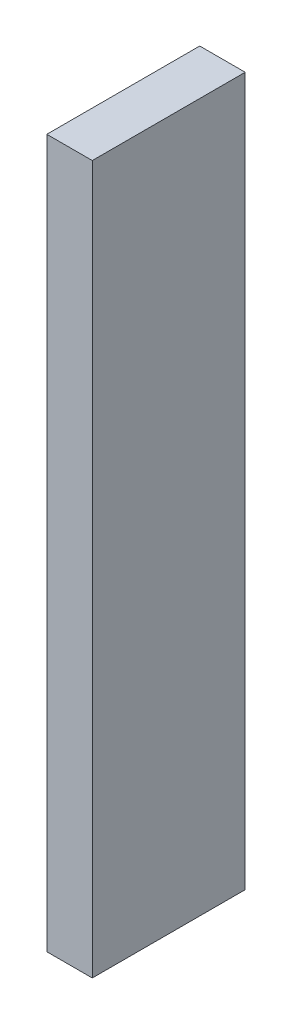
ISO-10303-21;
HEADER;
FILE_DESCRIPTION(('STEP AP214'),'2;1');
FILE_NAME('part.step','',(''),(''),'','','');
FILE_SCHEMA(('AUTOMOTIVE_DESIGN { 1 0 10303 214 1 1 1 1 }'));
ENDSEC;
DATA;
#1=APPLICATION_CONTEXT('core data for automotive mechanical design processes');
#2=APPLICATION_PROTOCOL_DEFINITION('international standard','automotive_design',2000,#1);
#3=PRODUCT_CONTEXT('',#1,'mechanical');
#4=PRODUCT('Part','Part','',(#3));
#5=PRODUCT_RELATED_PRODUCT_CATEGORY('part','',(#4));
#6=PRODUCT_DEFINITION_FORMATION('','',#4);
#7=PRODUCT_DEFINITION_CONTEXT('part definition',#1,'design');
#8=PRODUCT_DEFINITION('design','',#6,#7);
#9=PRODUCT_DEFINITION_SHAPE('','',#8);
#10=(LENGTH_UNIT() NAMED_UNIT(*) SI_UNIT(.MILLI.,.METRE.));
#11=(NAMED_UNIT(*) PLANE_ANGLE_UNIT() SI_UNIT($,.RADIAN.));
#12=(NAMED_UNIT(*) SI_UNIT($,.STERADIAN.) SOLID_ANGLE_UNIT());
#13=UNCERTAINTY_MEASURE_WITH_UNIT(LENGTH_MEASURE(1.E-05),#10,'distance_accuracy_value','');
#14=(GEOMETRIC_REPRESENTATION_CONTEXT(3) GLOBAL_UNCERTAINTY_ASSIGNED_CONTEXT((#13)) GLOBAL_UNIT_ASSIGNED_CONTEXT((#10,
#11,#12)) REPRESENTATION_CONTEXT('',''));
#15=CARTESIAN_POINT('',(0.,0.,0.));
#16=DIRECTION('',(0.,0.,1.));
#17=DIRECTION('',(1.,0.,0.));
#18=AXIS2_PLACEMENT_3D('',#15,#16,#17);
#19=CARTESIAN_POINT('',(130.275545187092,22.4180708263693,101.072028202897));
#20=DIRECTION('',(-1.69244514382854E-09,0.,1.));
#21=DIRECTION('',(1.,0.,1.69244514382854E-09));
#22=AXIS2_PLACEMENT_3D('',#19,#20,#21);
#23=PLANE('',#22);
#24=DIRECTION('',(0.,-1.,0.));
#25=VECTOR('',#24,1.);
#26=CARTESIAN_POINT('',(131.258630284105,22.4180708263693,101.072028204561));
#27=LINE('',#26,#25);
#28=CARTESIAN_POINT('',(131.258630284105,22.4180708263693,101.072028204561));
#29=VERTEX_POINT('',#28);
#30=CARTESIAN_POINT('',(131.258630284105,7.11212965552236,101.072028204561));
#31=VERTEX_POINT('',#30);
#32=EDGE_CURVE('E79',#29,#31,#27,.T.);
#33=ORIENTED_EDGE('',*,*,#32,.F.);
#34=DIRECTION('',(1.,0.,1.69244514382854E-09));
#35=VECTOR('',#34,1.);
#36=CARTESIAN_POINT('',(130.275545187092,22.4180708263693,101.072028202897));
#37=LINE('',#36,#35);
#38=CARTESIAN_POINT('',(130.275545187092,22.4180708263693,101.072028202897));
#39=VERTEX_POINT('',#38);
#40=EDGE_CURVE('E32',#39,#29,#37,.T.);
#41=ORIENTED_EDGE('',*,*,#40,.F.);
#42=DIRECTION('',(0.,-1.,0.));
#43=VECTOR('',#42,1.);
#44=CARTESIAN_POINT('',(130.275545187092,22.4180708263693,101.072028202897));
#45=LINE('',#44,#43);
#46=CARTESIAN_POINT('',(130.275545187092,7.11212965552236,101.072028202897));
#47=VERTEX_POINT('',#46);
#48=EDGE_CURVE('E71',#39,#47,#45,.T.);
#49=ORIENTED_EDGE('',*,*,#48,.T.);
#50=DIRECTION('',(1.,0.,1.69244514382854E-09));
#51=VECTOR('',#50,1.);
#52=CARTESIAN_POINT('',(130.275545187092,7.11212965552236,101.072028202897));
#53=LINE('',#52,#51);
#54=EDGE_CURVE('E10',#47,#31,#53,.T.);
#55=ORIENTED_EDGE('',*,*,#54,.T.);
#56=EDGE_LOOP('',(#33,#41,#49,#55));
#57=FACE_BOUND('',#56,.T.);
#58=ADVANCED_FACE('F16',(#57),#23,.T.);
#59=CARTESIAN_POINT('',(130.275545187092,7.11212965552236,101.072028202897));
#60=DIRECTION('',(0.,-1.,0.));
#61=DIRECTION('',(0.,0.,-1.));
#62=AXIS2_PLACEMENT_3D('',#59,#60,#61);
#63=PLANE('',#62);
#64=DIRECTION('',(1.69244514382854E-09,0.,-1.));
#65=VECTOR('',#64,1.);
#66=CARTESIAN_POINT('',(131.258630284105,7.11212965552236,101.072028204561));
#67=LINE('',#66,#65);
#68=CARTESIAN_POINT('',(131.2586302897,7.11212965552235,97.766087033712));
#69=VERTEX_POINT('',#68);
#70=EDGE_CURVE('E82',#31,#69,#67,.T.);
#71=ORIENTED_EDGE('',*,*,#70,.F.);
#72=ORIENTED_EDGE('',*,*,#54,.F.);
#73=DIRECTION('',(1.69244514382854E-09,0.,-1.));
#74=VECTOR('',#73,1.);
#75=CARTESIAN_POINT('',(130.275545187092,7.11212965552236,101.072028202897));
#76=LINE('',#75,#74);
#77=CARTESIAN_POINT('',(130.275545192687,7.11212965552235,97.7660870320482));
#78=VERTEX_POINT('',#77);
#79=EDGE_CURVE('E67',#47,#78,#76,.T.);
#80=ORIENTED_EDGE('',*,*,#79,.T.);
#81=DIRECTION('',(1.,0.,1.69244514382854E-09));
#82=VECTOR('',#81,1.);
#83=CARTESIAN_POINT('',(130.275545192687,7.11212965552235,97.7660870320482));
#84=LINE('',#83,#82);
#85=EDGE_CURVE('E24',#78,#69,#84,.T.);
#86=ORIENTED_EDGE('',*,*,#85,.T.);
#87=EDGE_LOOP('',(#71,#72,#80,#86));
#88=FACE_BOUND('',#87,.T.);
#89=ADVANCED_FACE('F68',(#88),#63,.T.);
#90=CARTESIAN_POINT('',(130.275545192687,7.11212965552235,97.7660870320482));
#91=DIRECTION('',(1.69244514382854E-09,0.,-1.));
#92=DIRECTION('',(-1.,0.,-1.69244514382854E-09));
#93=AXIS2_PLACEMENT_3D('',#90,#91,#92);
#94=PLANE('',#93);
#95=DIRECTION('',(0.,1.,0.));
#96=VECTOR('',#95,1.);
#97=CARTESIAN_POINT('',(131.2586302897,7.11212965552235,97.766087033712));
#98=LINE('',#97,#96);
#99=CARTESIAN_POINT('',(131.2586302897,22.418070826371,97.7660870252515));
#100=VERTEX_POINT('',#99);
#101=EDGE_CURVE('E65',#69,#100,#98,.T.);
#102=ORIENTED_EDGE('',*,*,#101,.F.);
#103=ORIENTED_EDGE('',*,*,#85,.F.);
#104=DIRECTION('',(0.,1.,0.));
#105=VECTOR('',#104,1.);
#106=CARTESIAN_POINT('',(130.275545192687,7.11212965552235,97.7660870320482));
#107=LINE('',#106,#105);
#108=CARTESIAN_POINT('',(130.275545192687,22.418070826371,97.7660870235876));
#109=VERTEX_POINT('',#108);
#110=EDGE_CURVE('E62',#78,#109,#107,.T.);
#111=ORIENTED_EDGE('',*,*,#110,.T.);
#112=DIRECTION('',(1.,0.,1.69244514382854E-09));
#113=VECTOR('',#112,1.);
#114=CARTESIAN_POINT('',(130.275545192687,22.418070826371,97.7660870235876));
#115=LINE('',#114,#113);
#116=EDGE_CURVE('E48',#109,#100,#115,.T.);
#117=ORIENTED_EDGE('',*,*,#116,.T.);
#118=EDGE_LOOP('',(#102,#103,#111,#117));
#119=FACE_BOUND('',#118,.T.);
#120=ADVANCED_FACE('F60',(#119),#94,.T.);
#121=CARTESIAN_POINT('',(130.275545192687,22.418070826371,97.7660870235876));
#122=DIRECTION('',(0.,1.,0.));
#123=DIRECTION('',(-1.,0.,0.));
#124=AXIS2_PLACEMENT_3D('',#121,#122,#123);
#125=PLANE('',#124);
#126=DIRECTION('',(-1.69244514382854E-09,0.,1.));
#127=VECTOR('',#126,1.);
#128=CARTESIAN_POINT('',(131.2586302897,22.418070826371,97.7660870252515));
#129=LINE('',#128,#127);
#130=EDGE_CURVE('E85',#100,#29,#129,.T.);
#131=ORIENTED_EDGE('',*,*,#130,.F.);
#132=ORIENTED_EDGE('',*,*,#116,.F.);
#133=DIRECTION('',(-1.69244514382854E-09,0.,1.));
#134=VECTOR('',#133,1.);
#135=CARTESIAN_POINT('',(130.275545192687,22.418070826371,97.7660870235876));
#136=LINE('',#135,#134);
#137=EDGE_CURVE('E74',#109,#39,#136,.T.);
#138=ORIENTED_EDGE('',*,*,#137,.T.);
#139=ORIENTED_EDGE('',*,*,#40,.T.);
#140=EDGE_LOOP('',(#131,#132,#138,#139));
#141=FACE_BOUND('',#140,.T.);
#142=ADVANCED_FACE('F96',(#141),#125,.T.);
#143=CARTESIAN_POINT('',(130.275545201028,17.2651002409467,92.8378644340291));
#144=DIRECTION('',(1.,0.,1.69244514382854E-09));
#145=DIRECTION('',(0.,1.,0.));
#146=AXIS2_PLACEMENT_3D('',#143,#144,#145);
#147=PLANE('',#146);
#148=ORIENTED_EDGE('',*,*,#48,.F.);
#149=ORIENTED_EDGE('',*,*,#137,.F.);
#150=ORIENTED_EDGE('',*,*,#110,.F.);
#151=ORIENTED_EDGE('',*,*,#79,.F.);
#152=EDGE_LOOP('',(#148,#149,#150,#151));
#153=FACE_BOUND('',#152,.T.);
#154=ADVANCED_FACE('F73',(#153),#147,.F.);
#155=CARTESIAN_POINT('',(131.258630298041,17.2651002409467,92.8378644356929));
#156=DIRECTION('',(1.,0.,1.69244514382854E-09));
#157=DIRECTION('',(0.,1.,0.));
#158=AXIS2_PLACEMENT_3D('',#155,#156,#157);
#159=PLANE('',#158);
#160=ORIENTED_EDGE('',*,*,#32,.T.);
#161=ORIENTED_EDGE('',*,*,#70,.T.);
#162=ORIENTED_EDGE('',*,*,#101,.T.);
#163=ORIENTED_EDGE('',*,*,#130,.T.);
#164=EDGE_LOOP('',(#160,#161,#162,#163));
#165=FACE_BOUND('',#164,.T.);
#166=ADVANCED_FACE('F89',(#165),#159,.T.);
#167=CLOSED_SHELL('',(#58,#89,#120,#142,#154,#166));
#168=MANIFOLD_SOLID_BREP('B1',#167);
#169=ADVANCED_BREP_SHAPE_REPRESENTATION('',(#18,#168),#14);
#170=SHAPE_DEFINITION_REPRESENTATION(#9,#169);
ENDSEC;
END-ISO-10303-21;
